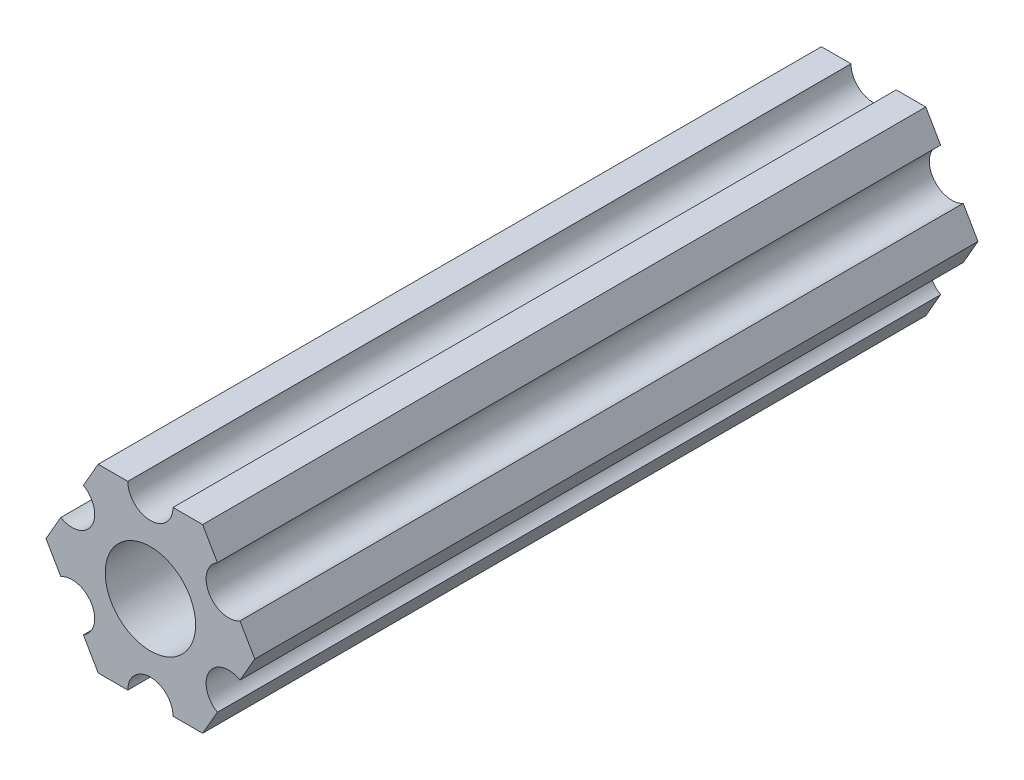
ISO-10303-21;
HEADER;
FILE_DESCRIPTION(('STEP AP214'),'2;1');
FILE_NAME('part.step','',(''),(''),'','','');
FILE_SCHEMA(('AUTOMOTIVE_DESIGN { 1 0 10303 214 1 1 1 1 }'));
ENDSEC;
DATA;
#1=APPLICATION_CONTEXT('core data for automotive mechanical design processes');
#2=APPLICATION_PROTOCOL_DEFINITION('international standard','automotive_design',2000,#1);
#3=PRODUCT_CONTEXT('',#1,'mechanical');
#4=PRODUCT('Part','Part','',(#3));
#5=PRODUCT_RELATED_PRODUCT_CATEGORY('part','',(#4));
#6=PRODUCT_DEFINITION_FORMATION('','',#4);
#7=PRODUCT_DEFINITION_CONTEXT('part definition',#1,'design');
#8=PRODUCT_DEFINITION('design','',#6,#7);
#9=PRODUCT_DEFINITION_SHAPE('','',#8);
#10=(LENGTH_UNIT() NAMED_UNIT(*) SI_UNIT(.MILLI.,.METRE.));
#11=(NAMED_UNIT(*) PLANE_ANGLE_UNIT() SI_UNIT($,.RADIAN.));
#12=(NAMED_UNIT(*) SI_UNIT($,.STERADIAN.) SOLID_ANGLE_UNIT());
#13=UNCERTAINTY_MEASURE_WITH_UNIT(LENGTH_MEASURE(1.E-05),#10,'distance_accuracy_value','');
#14=(GEOMETRIC_REPRESENTATION_CONTEXT(3) GLOBAL_UNCERTAINTY_ASSIGNED_CONTEXT((#13)) GLOBAL_UNIT_ASSIGNED_CONTEXT((#10,
#11,#12)) REPRESENTATION_CONTEXT('',''));
#15=CARTESIAN_POINT('',(0.,0.,0.));
#16=DIRECTION('',(0.,0.,1.));
#17=DIRECTION('',(1.,0.,0.));
#18=AXIS2_PLACEMENT_3D('',#15,#16,#17);
#19=CARTESIAN_POINT('',(-5.49926150638083,-3.17499966684068,-50.8));
#20=DIRECTION('',(0.,0.,1.));
#21=DIRECTION('',(1.,0.,0.));
#22=AXIS2_PLACEMENT_3D('',#19,#20,#21);
#23=CYLINDRICAL_SURFACE('',#22,1.58750000000001);
#24=CARTESIAN_POINT('',(-5.49926150638083,-3.17499966684068,0.));
#25=DIRECTION('',(0.,0.,-1.));
#26=DIRECTION('',(-1.,0.,0.));
#27=AXIS2_PLACEMENT_3D('',#24,#25,#26);
#28=CIRCLE('',#27,1.58750000000001);
#29=CARTESIAN_POINT('',(-6.29301142309098,-1.80018429024546,0.));
#30=VERTEX_POINT('',#29);
#31=CARTESIAN_POINT('',(-4.70551158967068,-4.54981504343589,0.));
#32=VERTEX_POINT('',#31);
#33=EDGE_CURVE('E208',#30,#32,#28,.T.);
#34=ORIENTED_EDGE('',*,*,#33,.F.);
#35=DIRECTION('',(0.,0.,1.));
#36=VECTOR('',#35,1.);
#37=CARTESIAN_POINT('',(-6.29301142309098,-1.80018429024546,-50.8));
#38=LINE('',#37,#36);
#39=CARTESIAN_POINT('',(-6.29301142309098,-1.80018429024546,-50.8));
#40=VERTEX_POINT('',#39);
#41=EDGE_CURVE('E11',#40,#30,#38,.T.);
#42=ORIENTED_EDGE('',*,*,#41,.F.);
#43=CARTESIAN_POINT('',(-5.49926150638083,-3.17499966684068,-50.8));
#44=DIRECTION('',(0.,0.,-1.));
#45=DIRECTION('',(-1.,0.,0.));
#46=AXIS2_PLACEMENT_3D('',#43,#44,#45);
#47=CIRCLE('',#46,1.58750000000001);
#48=CARTESIAN_POINT('',(-4.70551158967068,-4.54981504343589,-50.8));
#49=VERTEX_POINT('',#48);
#50=EDGE_CURVE('E277',#40,#49,#47,.T.);
#51=ORIENTED_EDGE('',*,*,#50,.T.);
#52=DIRECTION('',(0.,0.,1.));
#53=VECTOR('',#52,1.);
#54=CARTESIAN_POINT('',(-4.70551158967068,-4.54981504343589,-50.8));
#55=LINE('',#54,#53);
#56=EDGE_CURVE('E47',#49,#32,#55,.T.);
#57=ORIENTED_EDGE('',*,*,#56,.T.);
#58=EDGE_LOOP('',(#34,#42,#51,#57));
#59=FACE_BOUND('',#58,.T.);
#60=ADVANCED_FACE('F44',(#59),#23,.F.);
#61=CARTESIAN_POINT('',(-7.33234841870826,4.44212518856872E-07,-50.8));
#62=DIRECTION('',(-0.866025434075723,-0.499999947533953,0.));
#63=DIRECTION('',(0.499999947533953,-0.866025434075723,0.));
#64=AXIS2_PLACEMENT_3D('',#61,#62,#63);
#65=PLANE('',#64);
#66=DIRECTION('',(0.499999947533953,-0.866025434075723,0.));
#67=VECTOR('',#66,1.);
#68=CARTESIAN_POINT('',(-7.33234841870826,4.44212518856872E-07,0.));
#69=LINE('',#68,#67);
#70=CARTESIAN_POINT('',(-7.33234841870826,4.44212518856872E-07,0.));
#71=VERTEX_POINT('',#70);
#72=EDGE_CURVE('E274',#71,#30,#69,.T.);
#73=ORIENTED_EDGE('',*,*,#72,.F.);
#74=DIRECTION('',(0.,0.,1.));
#75=VECTOR('',#74,1.);
#76=CARTESIAN_POINT('',(-7.33234841870826,4.44212518856872E-07,-50.8));
#77=LINE('',#76,#75);
#78=CARTESIAN_POINT('',(-7.33234841870826,4.44212518856872E-07,-50.8));
#79=VERTEX_POINT('',#78);
#80=EDGE_CURVE('E54',#79,#71,#77,.T.);
#81=ORIENTED_EDGE('',*,*,#80,.F.);
#82=DIRECTION('',(0.499999947533953,-0.866025434075723,0.));
#83=VECTOR('',#82,1.);
#84=CARTESIAN_POINT('',(-7.33234841870826,4.44212518856872E-07,-50.8));
#85=LINE('',#84,#83);
#86=EDGE_CURVE('E193',#79,#40,#85,.T.);
#87=ORIENTED_EDGE('',*,*,#86,.T.);
#88=ORIENTED_EDGE('',*,*,#41,.T.);
#89=EDGE_LOOP('',(#73,#81,#87,#88));
#90=FACE_BOUND('',#89,.T.);
#91=ADVANCED_FACE('F327',(#90),#65,.T.);
#92=CARTESIAN_POINT('',(-6.29301120497139,1.80018505273895,-50.8));
#93=DIRECTION('',(-0.866025373493145,0.500000052466056,0.));
#94=DIRECTION('',(-0.500000052466056,-0.866025373493145,0.));
#95=AXIS2_PLACEMENT_3D('',#92,#93,#94);
#96=PLANE('',#95);
#97=DIRECTION('',(-0.500000052466056,-0.866025373493145,0.));
#98=VECTOR('',#97,1.);
#99=CARTESIAN_POINT('',(-6.29301120497139,1.80018505273895,0.));
#100=LINE('',#99,#98);
#101=CARTESIAN_POINT('',(-6.29301120497139,1.80018505273895,0.));
#102=VERTEX_POINT('',#101);
#103=EDGE_CURVE('E179',#102,#71,#100,.T.);
#104=ORIENTED_EDGE('',*,*,#103,.F.);
#105=DIRECTION('',(0.,0.,1.));
#106=VECTOR('',#105,1.);
#107=CARTESIAN_POINT('',(-6.29301120497139,1.80018505273895,-50.8));
#108=LINE('',#107,#106);
#109=CARTESIAN_POINT('',(-6.29301120497139,1.80018505273895,-50.8));
#110=VERTEX_POINT('',#109);
#111=EDGE_CURVE('E174',#110,#102,#108,.T.);
#112=ORIENTED_EDGE('',*,*,#111,.F.);
#113=DIRECTION('',(-0.500000052466056,-0.866025373493145,0.));
#114=VECTOR('',#113,1.);
#115=CARTESIAN_POINT('',(-6.29301120497139,1.80018505273895,-50.8));
#116=LINE('',#115,#114);
#117=EDGE_CURVE('E177',#110,#79,#116,.T.);
#118=ORIENTED_EDGE('',*,*,#117,.T.);
#119=ORIENTED_EDGE('',*,*,#80,.T.);
#120=EDGE_LOOP('',(#104,#112,#118,#119));
#121=FACE_BOUND('',#120,.T.);
#122=ADVANCED_FACE('F176',(#121),#96,.T.);
#123=CARTESIAN_POINT('',(-5.49926112168152,3.17500033315931,-50.8));
#124=DIRECTION('',(0.,0.,1.));
#125=DIRECTION('',(1.,0.,0.));
#126=AXIS2_PLACEMENT_3D('',#123,#124,#125);
#127=CYLINDRICAL_SURFACE('',#126,1.5875);
#128=CARTESIAN_POINT('',(-5.49926112168152,3.17500033315931,0.));
#129=DIRECTION('',(0.,0.,-1.));
#130=DIRECTION('',(-1.,0.,0.));
#131=AXIS2_PLACEMENT_3D('',#128,#129,#130);
#132=CIRCLE('',#131,1.5875);
#133=CARTESIAN_POINT('',(-4.70551103839166,4.54981561357968,0.));
#134=VERTEX_POINT('',#133);
#135=EDGE_CURVE('E269',#134,#102,#132,.T.);
#136=ORIENTED_EDGE('',*,*,#135,.F.);
#137=DIRECTION('',(0.,0.,1.));
#138=VECTOR('',#137,1.);
#139=CARTESIAN_POINT('',(-4.70551103839166,4.54981561357968,-50.8));
#140=LINE('',#139,#138);
#141=CARTESIAN_POINT('',(-4.70551103839166,4.54981561357968,-50.8));
#142=VERTEX_POINT('',#141);
#143=EDGE_CURVE('E185',#142,#134,#140,.T.);
#144=ORIENTED_EDGE('',*,*,#143,.F.);
#145=CARTESIAN_POINT('',(-5.49926112168152,3.17500033315931,-50.8));
#146=DIRECTION('',(0.,0.,-1.));
#147=DIRECTION('',(-1.,0.,0.));
#148=AXIS2_PLACEMENT_3D('',#145,#146,#147);
#149=CIRCLE('',#148,1.5875);
#150=EDGE_CURVE('E191',#142,#110,#149,.T.);
#151=ORIENTED_EDGE('',*,*,#150,.T.);
#152=ORIENTED_EDGE('',*,*,#111,.T.);
#153=EDGE_LOOP('',(#136,#144,#151,#152));
#154=FACE_BOUND('',#153,.T.);
#155=ADVANCED_FACE('F196',(#154),#127,.F.);
#156=CARTESIAN_POINT('',(-3.66617382465472,6.35000022210622,-50.8));
#157=DIRECTION('',(-0.866025373493145,0.500000052466056,0.));
#158=DIRECTION('',(-0.500000052466056,-0.866025373493145,0.));
#159=AXIS2_PLACEMENT_3D('',#156,#157,#158);
#160=PLANE('',#159);
#161=DIRECTION('',(-0.500000052466056,-0.866025373493145,0.));
#162=VECTOR('',#161,1.);
#163=CARTESIAN_POINT('',(-3.66617382465472,6.35000022210622,0.));
#164=LINE('',#163,#162);
#165=CARTESIAN_POINT('',(-3.66617382465472,6.35000022210622,0.));
#166=VERTEX_POINT('',#165);
#167=EDGE_CURVE('E265',#166,#134,#164,.T.);
#168=ORIENTED_EDGE('',*,*,#167,.F.);
#169=DIRECTION('',(0.,0.,1.));
#170=VECTOR('',#169,1.);
#171=CARTESIAN_POINT('',(-3.66617382465472,6.35000022210622,-50.8));
#172=LINE('',#171,#170);
#173=CARTESIAN_POINT('',(-3.66617382465472,6.35000022210622,-50.8));
#174=VERTEX_POINT('',#173);
#175=EDGE_CURVE('E283',#174,#166,#172,.T.);
#176=ORIENTED_EDGE('',*,*,#175,.F.);
#177=DIRECTION('',(-0.500000052466056,-0.866025373493145,0.));
#178=VECTOR('',#177,1.);
#179=CARTESIAN_POINT('',(-3.66617382465472,6.35000022210622,-50.8));
#180=LINE('',#179,#178);
#181=EDGE_CURVE('E198',#174,#142,#180,.T.);
#182=ORIENTED_EDGE('',*,*,#181,.T.);
#183=ORIENTED_EDGE('',*,*,#143,.T.);
#184=EDGE_LOOP('',(#168,#176,#182,#183));
#185=FACE_BOUND('',#184,.T.);
#186=ADVANCED_FACE('F340',(#185),#160,.T.);
#187=CARTESIAN_POINT('',(-1.58749846120262,6.35000022210623,-50.8));
#188=DIRECTION('',(0.,1.,0.));
#189=DIRECTION('',(-1.,0.,0.));
#190=AXIS2_PLACEMENT_3D('',#187,#188,#189);
#191=PLANE('',#190);
#192=DIRECTION('',(-1.,0.,0.));
#193=VECTOR('',#192,1.);
#194=CARTESIAN_POINT('',(-1.58749846120262,6.35000022210623,0.));
#195=LINE('',#194,#193);
#196=CARTESIAN_POINT('',(-1.58749846120262,6.35000022210623,0.));
#197=VERTEX_POINT('',#196);
#198=EDGE_CURVE('E261',#197,#166,#195,.T.);
#199=ORIENTED_EDGE('',*,*,#198,.F.);
#200=DIRECTION('',(0.,0.,1.));
#201=VECTOR('',#200,1.);
#202=CARTESIAN_POINT('',(-1.58749846120262,6.35000022210623,-50.8));
#203=LINE('',#202,#201);
#204=CARTESIAN_POINT('',(-1.58749846120262,6.35000022210623,-50.8));
#205=VERTEX_POINT('',#204);
#206=EDGE_CURVE('E286',#205,#197,#203,.T.);
#207=ORIENTED_EDGE('',*,*,#206,.F.);
#208=DIRECTION('',(-1.,0.,0.));
#209=VECTOR('',#208,1.);
#210=CARTESIAN_POINT('',(-1.58749846120262,6.35000022210623,-50.8));
#211=LINE('',#210,#209);
#212=EDGE_CURVE('E202',#205,#174,#211,.T.);
#213=ORIENTED_EDGE('',*,*,#212,.T.);
#214=ORIENTED_EDGE('',*,*,#175,.T.);
#215=EDGE_LOOP('',(#199,#207,#213,#214));
#216=FACE_BOUND('',#215,.T.);
#217=ADVANCED_FACE('F343',(#216),#191,.T.);
#218=CARTESIAN_POINT('',(3.84699344941095E-07,6.35000022210623,-50.8));
#219=DIRECTION('',(0.,0.,1.));
#220=DIRECTION('',(1.,0.,0.));
#221=AXIS2_PLACEMENT_3D('',#218,#219,#220);
#222=CYLINDRICAL_SURFACE('',#221,1.58749846120262);
#223=CARTESIAN_POINT('',(3.84699344941095E-07,6.35000022210623,0.));
#224=DIRECTION('',(0.,0.,-1.));
#225=DIRECTION('',(-1.,0.,0.));
#226=AXIS2_PLACEMENT_3D('',#223,#224,#225);
#227=CIRCLE('',#226,1.58749846120262);
#228=CARTESIAN_POINT('',(1.58749884590197,6.35000022210623,0.));
#229=VERTEX_POINT('',#228);
#230=EDGE_CURVE('E257',#229,#197,#227,.T.);
#231=ORIENTED_EDGE('',*,*,#230,.F.);
#232=DIRECTION('',(0.,0.,1.));
#233=VECTOR('',#232,1.);
#234=CARTESIAN_POINT('',(1.58749884590197,6.35000022210623,-50.8));
#235=LINE('',#234,#233);
#236=CARTESIAN_POINT('',(1.58749884590197,6.35000022210623,-50.8));
#237=VERTEX_POINT('',#236);
#238=EDGE_CURVE('E289',#237,#229,#235,.T.);
#239=ORIENTED_EDGE('',*,*,#238,.F.);
#240=CARTESIAN_POINT('',(3.84699344941095E-07,6.35000022210623,-50.8));
#241=DIRECTION('',(0.,0.,-1.));
#242=DIRECTION('',(-1.,0.,0.));
#243=AXIS2_PLACEMENT_3D('',#240,#241,#242);
#244=CIRCLE('',#243,1.58749846120262);
#245=EDGE_CURVE('E463',#237,#205,#244,.T.);
#246=ORIENTED_EDGE('',*,*,#245,.T.);
#247=ORIENTED_EDGE('',*,*,#206,.T.);
#248=EDGE_LOOP('',(#231,#239,#246,#247));
#249=FACE_BOUND('',#248,.T.);
#250=ADVANCED_FACE('F347',(#249),#222,.F.);
#251=CARTESIAN_POINT('',(3.66617452134701,6.35000022210623,-50.8));
#252=DIRECTION('',(0.,1.,0.));
#253=DIRECTION('',(-1.,0.,0.));
#254=AXIS2_PLACEMENT_3D('',#251,#252,#253);
#255=PLANE('',#254);
#256=DIRECTION('',(-1.,0.,0.));
#257=VECTOR('',#256,1.);
#258=CARTESIAN_POINT('',(3.66617452134701,6.35000022210623,0.));
#259=LINE('',#258,#257);
#260=CARTESIAN_POINT('',(3.66617452134701,6.35000022210623,0.));
#261=VERTEX_POINT('',#260);
#262=EDGE_CURVE('E253',#261,#229,#259,.T.);
#263=ORIENTED_EDGE('',*,*,#262,.F.);
#264=DIRECTION('',(0.,0.,1.));
#265=VECTOR('',#264,1.);
#266=CARTESIAN_POINT('',(3.66617452134701,6.35000022210623,-50.8));
#267=LINE('',#266,#265);
#268=CARTESIAN_POINT('',(3.66617452134701,6.35000022210623,-50.8));
#269=VERTEX_POINT('',#268);
#270=EDGE_CURVE('E292',#269,#261,#267,.T.);
#271=ORIENTED_EDGE('',*,*,#270,.F.);
#272=DIRECTION('',(-1.,0.,0.));
#273=VECTOR('',#272,1.);
#274=CARTESIAN_POINT('',(3.66617452134701,6.35000022210623,-50.8));
#275=LINE('',#274,#273);
#276=EDGE_CURVE('E459',#269,#237,#275,.T.);
#277=ORIENTED_EDGE('',*,*,#276,.T.);
#278=ORIENTED_EDGE('',*,*,#238,.T.);
#279=EDGE_LOOP('',(#263,#271,#277,#278));
#280=FACE_BOUND('',#279,.T.);
#281=ADVANCED_FACE('F351',(#280),#255,.T.);
#282=CARTESIAN_POINT('',(4.70551142760333,4.54981551649452,-50.8));
#283=DIRECTION('',(0.866025449221368,0.499999921300922,0.));
#284=DIRECTION('',(-0.499999921300922,0.866025449221368,0.));
#285=AXIS2_PLACEMENT_3D('',#282,#283,#284);
#286=PLANE('',#285);
#287=DIRECTION('',(-0.499999921300922,0.866025449221368,0.));
#288=VECTOR('',#287,1.);
#289=CARTESIAN_POINT('',(4.70551142760333,4.54981551649452,0.));
#290=LINE('',#289,#288);
#291=CARTESIAN_POINT('',(4.70551142760333,4.54981551649452,0.));
#292=VERTEX_POINT('',#291);
#293=EDGE_CURVE('E249',#292,#261,#290,.T.);
#294=ORIENTED_EDGE('',*,*,#293,.F.);
#295=DIRECTION('',(0.,0.,1.));
#296=VECTOR('',#295,1.);
#297=CARTESIAN_POINT('',(4.70551142760333,4.54981551649452,-50.8));
#298=LINE('',#297,#296);
#299=CARTESIAN_POINT('',(4.70551142760333,4.54981551649452,-50.8));
#300=VERTEX_POINT('',#299);
#301=EDGE_CURVE('E295',#300,#292,#298,.T.);
#302=ORIENTED_EDGE('',*,*,#301,.F.);
#303=DIRECTION('',(-0.499999921300922,0.866025449221368,0.));
#304=VECTOR('',#303,1.);
#305=CARTESIAN_POINT('',(4.70551142760333,4.54981551649452,-50.8));
#306=LINE('',#305,#304);
#307=EDGE_CURVE('E455',#300,#269,#306,.T.);
#308=ORIENTED_EDGE('',*,*,#307,.T.);
#309=ORIENTED_EDGE('',*,*,#270,.T.);
#310=EDGE_LOOP('',(#294,#302,#308,#309));
#311=FACE_BOUND('',#310,.T.);
#312=ADVANCED_FACE('F355',(#311),#286,.T.);
#313=CARTESIAN_POINT('',(5.49926130266854,3.1750001158556,-50.8));
#314=DIRECTION('',(0.,0.,1.));
#315=DIRECTION('',(1.,0.,0.));
#316=AXIS2_PLACEMENT_3D('',#313,#314,#315);
#317=CYLINDRICAL_SURFACE('',#316,1.5875);
#318=CARTESIAN_POINT('',(5.49926130266854,3.1750001158556,0.));
#319=DIRECTION('',(0.,0.,-1.));
#320=DIRECTION('',(-1.,0.,0.));
#321=AXIS2_PLACEMENT_3D('',#318,#319,#320);
#322=CIRCLE('',#321,1.5875);
#323=CARTESIAN_POINT('',(6.29301117773375,1.80018471521667,0.));
#324=VERTEX_POINT('',#323);
#325=EDGE_CURVE('E245',#324,#292,#322,.T.);
#326=ORIENTED_EDGE('',*,*,#325,.F.);
#327=DIRECTION('',(0.,0.,1.));
#328=VECTOR('',#327,1.);
#329=CARTESIAN_POINT('',(6.29301117773375,1.80018471521667,-50.8));
#330=LINE('',#329,#328);
#331=CARTESIAN_POINT('',(6.29301117773375,1.80018471521667,-50.8));
#332=VERTEX_POINT('',#331);
#333=EDGE_CURVE('E298',#332,#324,#330,.T.);
#334=ORIENTED_EDGE('',*,*,#333,.F.);
#335=CARTESIAN_POINT('',(5.49926130266854,3.1750001158556,-50.8));
#336=DIRECTION('',(0.,0.,-1.));
#337=DIRECTION('',(-1.,0.,0.));
#338=AXIS2_PLACEMENT_3D('',#335,#336,#337);
#339=CIRCLE('',#338,1.5875);
#340=EDGE_CURVE('E451',#332,#300,#339,.T.);
#341=ORIENTED_EDGE('',*,*,#340,.T.);
#342=ORIENTED_EDGE('',*,*,#301,.T.);
#343=EDGE_LOOP('',(#326,#334,#341,#342));
#344=FACE_BOUND('',#343,.T.);
#345=ADVANCED_FACE('F359',(#344),#317,.F.);
#346=CARTESIAN_POINT('',(7.33234803400895,9.61748368946088E-08,-50.8));
#347=DIRECTION('',(0.866025449221368,0.499999921300922,0.));
#348=DIRECTION('',(-0.499999921300922,0.866025449221368,0.));
#349=AXIS2_PLACEMENT_3D('',#346,#347,#348);
#350=PLANE('',#349);
#351=DIRECTION('',(-0.499999921300922,0.866025449221368,0.));
#352=VECTOR('',#351,1.);
#353=CARTESIAN_POINT('',(7.33234803400895,9.61748368946088E-08,0.));
#354=LINE('',#353,#352);
#355=CARTESIAN_POINT('',(7.33234803400895,9.61748368946088E-08,0.));
#356=VERTEX_POINT('',#355);
#357=EDGE_CURVE('E241',#356,#324,#354,.T.);
#358=ORIENTED_EDGE('',*,*,#357,.F.);
#359=DIRECTION('',(0.,0.,1.));
#360=VECTOR('',#359,1.);
#361=CARTESIAN_POINT('',(7.33234803400895,9.61748368946088E-08,-50.8));
#362=LINE('',#361,#360);
#363=CARTESIAN_POINT('',(7.33234803400895,9.61748368946088E-08,-50.8));
#364=VERTEX_POINT('',#363);
#365=EDGE_CURVE('E301',#364,#356,#362,.T.);
#366=ORIENTED_EDGE('',*,*,#365,.F.);
#367=DIRECTION('',(-0.499999921300922,0.866025449221368,0.));
#368=VECTOR('',#367,1.);
#369=CARTESIAN_POINT('',(7.33234803400895,9.61748368946088E-08,-50.8));
#370=LINE('',#369,#368);
#371=EDGE_CURVE('E447',#364,#332,#370,.T.);
#372=ORIENTED_EDGE('',*,*,#371,.T.);
#373=ORIENTED_EDGE('',*,*,#333,.T.);
#374=EDGE_LOOP('',(#358,#366,#372,#373));
#375=FACE_BOUND('',#374,.T.);
#376=ADVANCED_FACE('F363',(#375),#350,.T.);
#377=CARTESIAN_POINT('',(6.29301092933191,-1.80018457531732,-50.8));
#378=DIRECTION('',(0.866025403784438,-0.5,0.));
#379=DIRECTION('',(0.5,0.866025403784438,0.));
#380=AXIS2_PLACEMENT_3D('',#377,#378,#379);
#381=PLANE('',#380);
#382=DIRECTION('',(0.5,0.866025403784438,0.));
#383=VECTOR('',#382,1.);
#384=CARTESIAN_POINT('',(6.29301092933191,-1.80018457531732,0.));
#385=LINE('',#384,#383);
#386=CARTESIAN_POINT('',(6.29301092933191,-1.80018457531732,0.));
#387=VERTEX_POINT('',#386);
#388=EDGE_CURVE('E237',#387,#356,#385,.T.);
#389=ORIENTED_EDGE('',*,*,#388,.F.);
#390=DIRECTION('',(0.,0.,1.));
#391=VECTOR('',#390,1.);
#392=CARTESIAN_POINT('',(6.29301092933191,-1.80018457531732,-50.8));
#393=LINE('',#392,#391);
#394=CARTESIAN_POINT('',(6.29301092933191,-1.80018457531732,-50.8));
#395=VERTEX_POINT('',#394);
#396=EDGE_CURVE('E304',#395,#387,#393,.T.);
#397=ORIENTED_EDGE('',*,*,#396,.F.);
#398=DIRECTION('',(0.5,0.866025403784438,0.));
#399=VECTOR('',#398,1.);
#400=CARTESIAN_POINT('',(6.29301092933191,-1.80018457531732,-50.8));
#401=LINE('',#400,#399);
#402=EDGE_CURVE('E443',#395,#364,#401,.T.);
#403=ORIENTED_EDGE('',*,*,#402,.T.);
#404=ORIENTED_EDGE('',*,*,#365,.T.);
#405=EDGE_LOOP('',(#389,#397,#403,#404));
#406=FACE_BOUND('',#405,.T.);
#407=ADVANCED_FACE('F367',(#406),#381,.T.);
#408=CARTESIAN_POINT('',(5.49926092933191,-3.17499990382512,-50.8));
#409=DIRECTION('',(0.,0.,1.));
#410=DIRECTION('',(1.,0.,0.));
#411=AXIS2_PLACEMENT_3D('',#408,#409,#410);
#412=CYLINDRICAL_SURFACE('',#411,1.5875);
#413=CARTESIAN_POINT('',(5.49926092933191,-3.17499990382512,0.));
#414=DIRECTION('',(0.,0.,-1.));
#415=DIRECTION('',(-1.,0.,0.));
#416=AXIS2_PLACEMENT_3D('',#413,#414,#415);
#417=CIRCLE('',#416,1.5875);
#418=CARTESIAN_POINT('',(4.70551092933191,-4.54981523233291,0.));
#419=VERTEX_POINT('',#418);
#420=EDGE_CURVE('E233',#419,#387,#417,.T.);
#421=ORIENTED_EDGE('',*,*,#420,.F.);
#422=DIRECTION('',(0.,0.,1.));
#423=VECTOR('',#422,1.);
#424=CARTESIAN_POINT('',(4.70551092933191,-4.54981523233291,-50.8));
#425=LINE('',#424,#423);
#426=CARTESIAN_POINT('',(4.70551092933191,-4.54981523233291,-50.8));
#427=VERTEX_POINT('',#426);
#428=EDGE_CURVE('E307',#427,#419,#425,.T.);
#429=ORIENTED_EDGE('',*,*,#428,.F.);
#430=CARTESIAN_POINT('',(5.49926092933191,-3.17499990382512,-50.8));
#431=DIRECTION('',(0.,0.,-1.));
#432=DIRECTION('',(-1.,0.,0.));
#433=AXIS2_PLACEMENT_3D('',#430,#431,#432);
#434=CIRCLE('',#433,1.5875);
#435=EDGE_CURVE('E439',#427,#395,#434,.T.);
#436=ORIENTED_EDGE('',*,*,#435,.T.);
#437=ORIENTED_EDGE('',*,*,#396,.T.);
#438=EDGE_LOOP('',(#421,#429,#436,#437));
#439=FACE_BOUND('',#438,.T.);
#440=ADVANCED_FACE('F371',(#439),#412,.F.);
#441=CARTESIAN_POINT('',(3.66617382465481,-6.34999990382519,-50.8));
#442=DIRECTION('',(0.866025403784438,-0.5,0.));
#443=DIRECTION('',(0.5,0.866025403784439,0.));
#444=AXIS2_PLACEMENT_3D('',#441,#442,#443);
#445=PLANE('',#444);
#446=DIRECTION('',(0.5,0.866025403784439,0.));
#447=VECTOR('',#446,1.);
#448=CARTESIAN_POINT('',(3.66617382465481,-6.34999990382519,0.));
#449=LINE('',#448,#447);
#450=CARTESIAN_POINT('',(3.66617382465481,-6.34999990382519,0.));
#451=VERTEX_POINT('',#450);
#452=EDGE_CURVE('E229',#451,#419,#449,.T.);
#453=ORIENTED_EDGE('',*,*,#452,.F.);
#454=DIRECTION('',(0.,0.,1.));
#455=VECTOR('',#454,1.);
#456=CARTESIAN_POINT('',(3.66617382465481,-6.34999990382519,-50.8));
#457=LINE('',#456,#455);
#458=CARTESIAN_POINT('',(3.66617382465481,-6.34999990382519,-50.8));
#459=VERTEX_POINT('',#458);
#460=EDGE_CURVE('E310',#459,#451,#457,.T.);
#461=ORIENTED_EDGE('',*,*,#460,.F.);
#462=DIRECTION('',(0.5,0.866025403784439,0.));
#463=VECTOR('',#462,1.);
#464=CARTESIAN_POINT('',(3.66617382465481,-6.34999990382519,-50.8));
#465=LINE('',#464,#463);
#466=EDGE_CURVE('E435',#459,#427,#465,.T.);
#467=ORIENTED_EDGE('',*,*,#466,.T.);
#468=ORIENTED_EDGE('',*,*,#428,.T.);
#469=EDGE_LOOP('',(#453,#461,#467,#468));
#470=FACE_BOUND('',#469,.T.);
#471=ADVANCED_FACE('F375',(#470),#445,.T.);
#472=CARTESIAN_POINT('',(1.58750153879705,-6.34999990382519,-50.8));
#473=DIRECTION('',(0.,-1.,0.));
#474=DIRECTION('',(1.,0.,0.));
#475=AXIS2_PLACEMENT_3D('',#472,#473,#474);
#476=PLANE('',#475);
#477=DIRECTION('',(1.,0.,0.));
#478=VECTOR('',#477,1.);
#479=CARTESIAN_POINT('',(1.58750153879705,-6.34999990382519,0.));
#480=LINE('',#479,#478);
#481=CARTESIAN_POINT('',(1.58750153879705,-6.34999990382519,0.));
#482=VERTEX_POINT('',#481);
#483=EDGE_CURVE('E225',#482,#451,#480,.T.);
#484=ORIENTED_EDGE('',*,*,#483,.F.);
#485=DIRECTION('',(0.,0.,1.));
#486=VECTOR('',#485,1.);
#487=CARTESIAN_POINT('',(1.58750153879705,-6.34999990382519,-50.8));
#488=LINE('',#487,#486);
#489=CARTESIAN_POINT('',(1.58750153879705,-6.34999990382519,-50.8));
#490=VERTEX_POINT('',#489);
#491=EDGE_CURVE('E313',#490,#482,#488,.T.);
#492=ORIENTED_EDGE('',*,*,#491,.F.);
#493=DIRECTION('',(1.,0.,0.));
#494=VECTOR('',#493,1.);
#495=CARTESIAN_POINT('',(1.58750153879705,-6.34999990382519,-50.8));
#496=LINE('',#495,#494);
#497=EDGE_CURVE('E431',#490,#459,#496,.T.);
#498=ORIENTED_EDGE('',*,*,#497,.T.);
#499=ORIENTED_EDGE('',*,*,#460,.T.);
#500=EDGE_LOOP('',(#484,#492,#498,#499));
#501=FACE_BOUND('',#500,.T.);
#502=ADVANCED_FACE('F379',(#501),#476,.T.);
#503=CARTESIAN_POINT('',(-3.8469926204343E-07,-6.34999990382519,-50.8));
#504=DIRECTION('',(0.,0.,1.));
#505=DIRECTION('',(1.,0.,0.));
#506=AXIS2_PLACEMENT_3D('',#503,#504,#505);
#507=CYLINDRICAL_SURFACE('',#506,1.58750153879705);
#508=CARTESIAN_POINT('',(-3.8469926204343E-07,-6.34999990382519,0.));
#509=DIRECTION('',(0.,0.,-1.));
#510=DIRECTION('',(-1.,0.,0.));
#511=AXIS2_PLACEMENT_3D('',#508,#509,#510);
#512=CIRCLE('',#511,1.58750153879705);
#513=CARTESIAN_POINT('',(-1.58750192349631,-6.34999990382519,0.));
#514=VERTEX_POINT('',#513);
#515=EDGE_CURVE('E221',#514,#482,#512,.T.);
#516=ORIENTED_EDGE('',*,*,#515,.F.);
#517=DIRECTION('',(0.,0.,1.));
#518=VECTOR('',#517,1.);
#519=CARTESIAN_POINT('',(-1.58750192349631,-6.34999990382519,-50.8));
#520=LINE('',#519,#518);
#521=CARTESIAN_POINT('',(-1.58750192349631,-6.34999990382519,-50.8));
#522=VERTEX_POINT('',#521);
#523=EDGE_CURVE('E316',#522,#514,#520,.T.);
#524=ORIENTED_EDGE('',*,*,#523,.F.);
#525=CARTESIAN_POINT('',(-3.8469926204343E-07,-6.34999990382519,-50.8));
#526=DIRECTION('',(0.,0.,-1.));
#527=DIRECTION('',(-1.,0.,0.));
#528=AXIS2_PLACEMENT_3D('',#525,#526,#527);
#529=CIRCLE('',#528,1.58750153879705);
#530=EDGE_CURVE('E427',#522,#490,#529,.T.);
#531=ORIENTED_EDGE('',*,*,#530,.T.);
#532=ORIENTED_EDGE('',*,*,#491,.T.);
#533=EDGE_LOOP('',(#516,#524,#531,#532));
#534=FACE_BOUND('',#533,.T.);
#535=ADVANCED_FACE('F383',(#534),#507,.F.);
#536=CARTESIAN_POINT('',(-3.66617452134693,-6.34999990382519,-50.8));
#537=DIRECTION('',(0.,-1.,0.));
#538=DIRECTION('',(1.,0.,0.));
#539=AXIS2_PLACEMENT_3D('',#536,#537,#538);
#540=PLANE('',#539);
#541=DIRECTION('',(1.,0.,0.));
#542=VECTOR('',#541,1.);
#543=CARTESIAN_POINT('',(-3.66617452134693,-6.34999990382519,0.));
#544=LINE('',#543,#542);
#545=CARTESIAN_POINT('',(-3.66617452134693,-6.34999990382519,0.));
#546=VERTEX_POINT('',#545);
#547=EDGE_CURVE('E217',#546,#514,#544,.T.);
#548=ORIENTED_EDGE('',*,*,#547,.F.);
#549=DIRECTION('',(0.,0.,1.));
#550=VECTOR('',#549,1.);
#551=CARTESIAN_POINT('',(-3.66617452134693,-6.34999990382519,-50.8));
#552=LINE('',#551,#550);
#553=CARTESIAN_POINT('',(-3.66617452134693,-6.34999990382519,-50.8));
#554=VERTEX_POINT('',#553);
#555=EDGE_CURVE('E318',#554,#546,#552,.T.);
#556=ORIENTED_EDGE('',*,*,#555,.F.);
#557=DIRECTION('',(1.,0.,0.));
#558=VECTOR('',#557,1.);
#559=CARTESIAN_POINT('',(-3.66617452134693,-6.34999990382519,-50.8));
#560=LINE('',#559,#558);
#561=EDGE_CURVE('E423',#554,#522,#560,.T.);
#562=ORIENTED_EDGE('',*,*,#561,.T.);
#563=ORIENTED_EDGE('',*,*,#523,.T.);
#564=EDGE_LOOP('',(#548,#556,#562,#563));
#565=FACE_BOUND('',#564,.T.);
#566=ADVANCED_FACE('F387',(#565),#540,.T.);
#567=CARTESIAN_POINT('',(-4.70551158967068,-4.54981504343589,-50.8));
#568=DIRECTION('',(-0.866025434075723,-0.499999947533953,0.));
#569=DIRECTION('',(0.499999947533953,-0.866025434075723,0.));
#570=AXIS2_PLACEMENT_3D('',#567,#568,#569);
#571=PLANE('',#570);
#572=DIRECTION('',(0.499999947533953,-0.866025434075723,0.));
#573=VECTOR('',#572,1.);
#574=CARTESIAN_POINT('',(-4.70551158967068,-4.54981504343589,0.));
#575=LINE('',#574,#573);
#576=EDGE_CURVE('E212',#32,#546,#575,.T.);
#577=ORIENTED_EDGE('',*,*,#576,.F.);
#578=ORIENTED_EDGE('',*,*,#56,.F.);
#579=DIRECTION('',(0.499999947533953,-0.866025434075723,0.));
#580=VECTOR('',#579,1.);
#581=CARTESIAN_POINT('',(-4.70551158967068,-4.54981504343589,-50.8));
#582=LINE('',#581,#580);
#583=EDGE_CURVE('E420',#49,#554,#582,.T.);
#584=ORIENTED_EDGE('',*,*,#583,.T.);
#585=ORIENTED_EDGE('',*,*,#555,.T.);
#586=EDGE_LOOP('',(#577,#578,#584,#585));
#587=FACE_BOUND('',#586,.T.);
#588=ADVANCED_FACE('F324',(#587),#571,.T.);
#589=CARTESIAN_POINT('',(-5.49926150638083,-3.17499966684068,-50.8));
#590=DIRECTION('',(0.,0.,-1.));
#591=DIRECTION('',(-1.,0.,0.));
#592=AXIS2_PLACEMENT_3D('',#589,#590,#591);
#593=PLANE('',#592);
#594=CARTESIAN_POINT('',(0.,0.,-50.8));
#595=DIRECTION('',(0.,0.,1.));
#596=DIRECTION('',(1.,0.,0.));
#597=AXIS2_PLACEMENT_3D('',#594,#595,#596);
#598=CIRCLE('',#597,3.17499999999999);
#599=CARTESIAN_POINT('',(3.17499999999999,0.,-50.8));
#600=VERTEX_POINT('',#599);
#601=EDGE_CURVE('E213',#600,#600,#598,.T.);
#602=ORIENTED_EDGE('',*,*,#601,.T.);
#603=EDGE_LOOP('',(#602));
#604=FACE_BOUND('',#603,.T.);
#605=ORIENTED_EDGE('',*,*,#50,.F.);
#606=ORIENTED_EDGE('',*,*,#86,.F.);
#607=ORIENTED_EDGE('',*,*,#117,.F.);
#608=ORIENTED_EDGE('',*,*,#150,.F.);
#609=ORIENTED_EDGE('',*,*,#181,.F.);
#610=ORIENTED_EDGE('',*,*,#212,.F.);
#611=ORIENTED_EDGE('',*,*,#245,.F.);
#612=ORIENTED_EDGE('',*,*,#276,.F.);
#613=ORIENTED_EDGE('',*,*,#307,.F.);
#614=ORIENTED_EDGE('',*,*,#340,.F.);
#615=ORIENTED_EDGE('',*,*,#371,.F.);
#616=ORIENTED_EDGE('',*,*,#402,.F.);
#617=ORIENTED_EDGE('',*,*,#435,.F.);
#618=ORIENTED_EDGE('',*,*,#466,.F.);
#619=ORIENTED_EDGE('',*,*,#497,.F.);
#620=ORIENTED_EDGE('',*,*,#530,.F.);
#621=ORIENTED_EDGE('',*,*,#561,.F.);
#622=ORIENTED_EDGE('',*,*,#583,.F.);
#623=EDGE_LOOP('',(#605,#606,#607,#608,#609,#610,#611,#612,#613,#614,#615,#616,#617,#618,#619,
#620,#621,#622));
#624=FACE_BOUND('',#623,.T.);
#625=ADVANCED_FACE('F189',(#604,#624),#593,.T.);
#626=CARTESIAN_POINT('',(-5.49926150638083,-3.17499966684068,0.));
#627=DIRECTION('',(0.,0.,-1.));
#628=DIRECTION('',(-1.,0.,0.));
#629=AXIS2_PLACEMENT_3D('',#626,#627,#628);
#630=PLANE('',#629);
#631=CARTESIAN_POINT('',(0.,0.,0.));
#632=DIRECTION('',(0.,0.,1.));
#633=DIRECTION('',(1.,0.,0.));
#634=AXIS2_PLACEMENT_3D('',#631,#632,#633);
#635=CIRCLE('',#634,3.17499999999999);
#636=CARTESIAN_POINT('',(3.17499999999999,0.,0.));
#637=VERTEX_POINT('',#636);
#638=EDGE_CURVE('E411',#637,#637,#635,.T.);
#639=ORIENTED_EDGE('',*,*,#638,.F.);
#640=EDGE_LOOP('',(#639));
#641=FACE_BOUND('',#640,.T.);
#642=ORIENTED_EDGE('',*,*,#33,.T.);
#643=ORIENTED_EDGE('',*,*,#576,.T.);
#644=ORIENTED_EDGE('',*,*,#547,.T.);
#645=ORIENTED_EDGE('',*,*,#515,.T.);
#646=ORIENTED_EDGE('',*,*,#483,.T.);
#647=ORIENTED_EDGE('',*,*,#452,.T.);
#648=ORIENTED_EDGE('',*,*,#420,.T.);
#649=ORIENTED_EDGE('',*,*,#388,.T.);
#650=ORIENTED_EDGE('',*,*,#357,.T.);
#651=ORIENTED_EDGE('',*,*,#325,.T.);
#652=ORIENTED_EDGE('',*,*,#293,.T.);
#653=ORIENTED_EDGE('',*,*,#262,.T.);
#654=ORIENTED_EDGE('',*,*,#230,.T.);
#655=ORIENTED_EDGE('',*,*,#198,.T.);
#656=ORIENTED_EDGE('',*,*,#167,.T.);
#657=ORIENTED_EDGE('',*,*,#135,.T.);
#658=ORIENTED_EDGE('',*,*,#103,.T.);
#659=ORIENTED_EDGE('',*,*,#72,.T.);
#660=EDGE_LOOP('',(#642,#643,#644,#645,#646,#647,#648,#649,#650,#651,#652,#653,#654,#655,#656,
#657,#658,#659));
#661=FACE_BOUND('',#660,.T.);
#662=ADVANCED_FACE('F326',(#641,#661),#630,.F.);
#663=CARTESIAN_POINT('',(0.,0.,0.));
#664=DIRECTION('',(0.,0.,1.));
#665=DIRECTION('',(1.,0.,0.));
#666=AXIS2_PLACEMENT_3D('',#663,#664,#665);
#667=CYLINDRICAL_SURFACE('',#666,3.17499999999999);
#668=ORIENTED_EDGE('',*,*,#601,.F.);
#669=EDGE_LOOP('',(#668));
#670=FACE_BOUND('',#669,.T.);
#671=ORIENTED_EDGE('',*,*,#638,.T.);
#672=EDGE_LOOP('',(#671));
#673=FACE_BOUND('',#672,.T.);
#674=ADVANCED_FACE('F399',(#670,#673),#667,.F.);
#675=CLOSED_SHELL('',(#60,#91,#122,#155,#186,#217,#250,#281,#312,#345,#376,#407,#440,#471,#502,
#535,#566,#588,#625,#662,#674));
#676=MANIFOLD_SOLID_BREP('B2',#675);
#677=ADVANCED_BREP_SHAPE_REPRESENTATION('',(#18,#676),#14);
#678=SHAPE_DEFINITION_REPRESENTATION(#9,#677);
ENDSEC;
END-ISO-10303-21;
